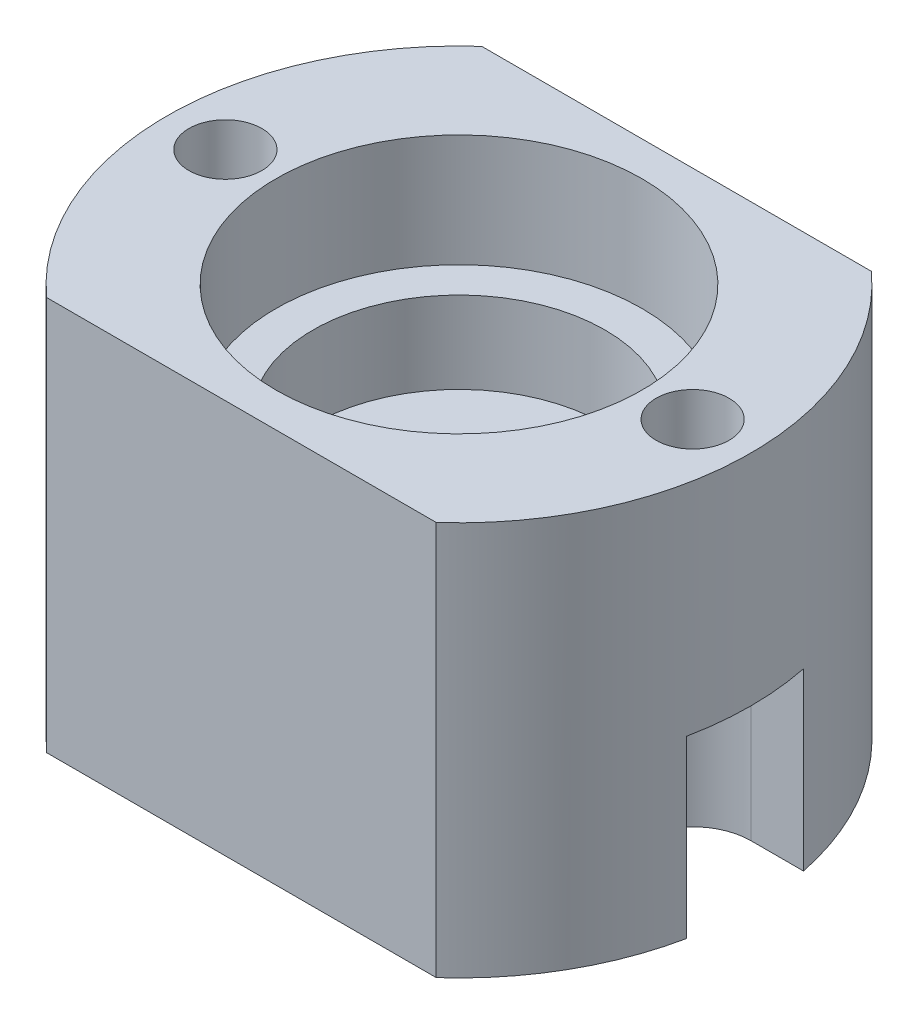
ISO-10303-21;
HEADER;
FILE_DESCRIPTION(('STEP AP214'),'2;1');
FILE_NAME('part.step','',(''),(''),'','','');
FILE_SCHEMA(('AUTOMOTIVE_DESIGN { 1 0 10303 214 1 1 1 1 }'));
ENDSEC;
DATA;
#1=APPLICATION_CONTEXT('core data for automotive mechanical design processes');
#2=APPLICATION_PROTOCOL_DEFINITION('international standard','automotive_design',2000,#1);
#3=PRODUCT_CONTEXT('',#1,'mechanical');
#4=PRODUCT('Part','Part','',(#3));
#5=PRODUCT_RELATED_PRODUCT_CATEGORY('part','',(#4));
#6=PRODUCT_DEFINITION_FORMATION('','',#4);
#7=PRODUCT_DEFINITION_CONTEXT('part definition',#1,'design');
#8=PRODUCT_DEFINITION('design','',#6,#7);
#9=PRODUCT_DEFINITION_SHAPE('','',#8);
#10=(LENGTH_UNIT() NAMED_UNIT(*) SI_UNIT(.MILLI.,.METRE.));
#11=(NAMED_UNIT(*) PLANE_ANGLE_UNIT() SI_UNIT($,.RADIAN.));
#12=(NAMED_UNIT(*) SI_UNIT($,.STERADIAN.) SOLID_ANGLE_UNIT());
#13=UNCERTAINTY_MEASURE_WITH_UNIT(LENGTH_MEASURE(1.E-05),#10,'distance_accuracy_value','');
#14=(GEOMETRIC_REPRESENTATION_CONTEXT(3) GLOBAL_UNCERTAINTY_ASSIGNED_CONTEXT((#13)) GLOBAL_UNIT_ASSIGNED_CONTEXT((#10,
#11,#12)) REPRESENTATION_CONTEXT('',''));
#15=CARTESIAN_POINT('',(0.,0.,0.));
#16=DIRECTION('',(0.,0.,1.));
#17=DIRECTION('',(1.,0.,0.));
#18=AXIS2_PLACEMENT_3D('',#15,#16,#17);
#19=CARTESIAN_POINT('',(0.,12.2555,0.));
#20=DIRECTION('',(0.,1.,0.));
#21=DIRECTION('',(0.,0.,1.));
#22=AXIS2_PLACEMENT_3D('',#19,#20,#21);
#23=PLANE('',#22);
#24=CARTESIAN_POINT('',(0.,12.2555,0.));
#25=DIRECTION('',(0.,1.,0.));
#26=DIRECTION('',(0.,0.,1.));
#27=AXIS2_PLACEMENT_3D('',#24,#25,#26);
#28=CIRCLE('',#27,7.9629);
#29=CARTESIAN_POINT('',(0.,12.2555,7.9629));
#30=VERTEX_POINT('',#29);
#31=EDGE_CURVE('E211',#30,#30,#28,.T.);
#32=ORIENTED_EDGE('',*,*,#31,.T.);
#33=EDGE_LOOP('',(#32));
#34=FACE_BOUND('',#33,.T.);
#35=CARTESIAN_POINT('',(0.,12.2555,0.));
#36=DIRECTION('',(0.,1.,0.));
#37=DIRECTION('',(0.,0.,1.));
#38=AXIS2_PLACEMENT_3D('',#35,#36,#37);
#39=CIRCLE('',#38,6.35);
#40=CARTESIAN_POINT('',(0.,12.2555,6.35));
#41=VERTEX_POINT('',#40);
#42=EDGE_CURVE('E20',#41,#41,#39,.F.);
#43=ORIENTED_EDGE('',*,*,#42,.T.);
#44=EDGE_LOOP('',(#43));
#45=FACE_BOUND('',#44,.T.);
#46=ADVANCED_FACE('F17',(#34,#45),#23,.T.);
#47=CARTESIAN_POINT('',(0.,8.6995,0.));
#48=DIRECTION('',(0.,1.,0.));
#49=DIRECTION('',(0.,0.,1.));
#50=AXIS2_PLACEMENT_3D('',#47,#48,#49);
#51=CYLINDRICAL_SURFACE('',#50,6.35);
#52=ORIENTED_EDGE('',*,*,#42,.F.);
#53=EDGE_LOOP('',(#52));
#54=FACE_BOUND('',#53,.T.);
#55=CARTESIAN_POINT('',(0.,8.6995,0.));
#56=DIRECTION('',(0.,1.,0.));
#57=DIRECTION('',(0.,0.,1.));
#58=AXIS2_PLACEMENT_3D('',#55,#56,#57);
#59=CIRCLE('',#58,6.35);
#60=CARTESIAN_POINT('',(0.,8.6995,6.35));
#61=VERTEX_POINT('',#60);
#62=EDGE_CURVE('E209',#61,#61,#59,.T.);
#63=ORIENTED_EDGE('',*,*,#62,.F.);
#64=EDGE_LOOP('',(#63));
#65=FACE_BOUND('',#64,.T.);
#66=ADVANCED_FACE('F219',(#54,#65),#51,.F.);
#67=CARTESIAN_POINT('',(0.,12.2555,0.));
#68=DIRECTION('',(0.,1.,0.));
#69=DIRECTION('',(0.,0.,1.));
#70=AXIS2_PLACEMENT_3D('',#67,#68,#69);
#71=CYLINDRICAL_SURFACE('',#70,7.9629);
#72=CARTESIAN_POINT('',(0.,17.145,0.));
#73=DIRECTION('',(0.,1.,0.));
#74=DIRECTION('',(0.,0.,1.));
#75=AXIS2_PLACEMENT_3D('',#72,#73,#74);
#76=CIRCLE('',#75,7.9629);
#77=CARTESIAN_POINT('',(0.,17.145,7.9629));
#78=VERTEX_POINT('',#77);
#79=EDGE_CURVE('E203',#78,#78,#76,.F.);
#80=ORIENTED_EDGE('',*,*,#79,.F.);
#81=EDGE_LOOP('',(#80));
#82=FACE_BOUND('',#81,.T.);
#83=ORIENTED_EDGE('',*,*,#31,.F.);
#84=EDGE_LOOP('',(#83));
#85=FACE_BOUND('',#84,.T.);
#86=ADVANCED_FACE('F222',(#82,#85),#71,.F.);
#87=CARTESIAN_POINT('',(-10.16,17.145,0.));
#88=DIRECTION('',(0.,-1.,0.));
#89=DIRECTION('',(0.,0.,-1.));
#90=AXIS2_PLACEMENT_3D('',#87,#88,#89);
#91=CYLINDRICAL_SURFACE('',#90,1.5875);
#92=CARTESIAN_POINT('',(-10.16,17.145,0.));
#93=DIRECTION('',(0.,-1.,0.));
#94=DIRECTION('',(0.,0.,-1.));
#95=AXIS2_PLACEMENT_3D('',#92,#93,#94);
#96=CIRCLE('',#95,1.5875);
#97=CARTESIAN_POINT('',(-10.16,17.145,-1.5875));
#98=VERTEX_POINT('',#97);
#99=EDGE_CURVE('E197',#98,#98,#96,.T.);
#100=ORIENTED_EDGE('',*,*,#99,.F.);
#101=EDGE_LOOP('',(#100));
#102=FACE_BOUND('',#101,.T.);
#103=CARTESIAN_POINT('',(-10.16,7.62,0.));
#104=DIRECTION('',(0.,-1.,0.));
#105=DIRECTION('',(0.,0.,-1.));
#106=AXIS2_PLACEMENT_3D('',#103,#104,#105);
#107=CIRCLE('',#106,1.5875);
#108=CARTESIAN_POINT('',(-10.16,7.62,-1.5875));
#109=VERTEX_POINT('',#108);
#110=EDGE_CURVE('E206',#109,#109,#107,.F.);
#111=ORIENTED_EDGE('',*,*,#110,.F.);
#112=EDGE_LOOP('',(#111));
#113=FACE_BOUND('',#112,.T.);
#114=ADVANCED_FACE('F330',(#102,#113),#91,.F.);
#115=CARTESIAN_POINT('',(10.16,17.145,0.));
#116=DIRECTION('',(0.,-1.,0.));
#117=DIRECTION('',(0.,0.,-1.));
#118=AXIS2_PLACEMENT_3D('',#115,#116,#117);
#119=CYLINDRICAL_SURFACE('',#118,1.5875);
#120=CARTESIAN_POINT('',(10.16,7.62,0.));
#121=DIRECTION('',(0.,-1.,0.));
#122=DIRECTION('',(0.,0.,-1.));
#123=AXIS2_PLACEMENT_3D('',#120,#121,#122);
#124=CIRCLE('',#123,1.5875);
#125=CARTESIAN_POINT('',(10.16,7.62,-1.5875));
#126=VERTEX_POINT('',#125);
#127=EDGE_CURVE('E194',#126,#126,#124,.F.);
#128=ORIENTED_EDGE('',*,*,#127,.F.);
#129=EDGE_LOOP('',(#128));
#130=FACE_BOUND('',#129,.T.);
#131=CARTESIAN_POINT('',(10.16,17.145,0.));
#132=DIRECTION('',(0.,-1.,0.));
#133=DIRECTION('',(0.,0.,-1.));
#134=AXIS2_PLACEMENT_3D('',#131,#132,#133);
#135=CIRCLE('',#134,1.5875);
#136=CARTESIAN_POINT('',(10.16,17.145,-1.5875));
#137=VERTEX_POINT('',#136);
#138=EDGE_CURVE('E200',#137,#137,#135,.T.);
#139=ORIENTED_EDGE('',*,*,#138,.F.);
#140=EDGE_LOOP('',(#139));
#141=FACE_BOUND('',#140,.T.);
#142=ADVANCED_FACE('F228',(#130,#141),#119,.F.);
#143=CARTESIAN_POINT('',(0.,8.6995,0.));
#144=DIRECTION('',(0.,1.,0.));
#145=DIRECTION('',(0.,0.,1.));
#146=AXIS2_PLACEMENT_3D('',#143,#144,#145);
#147=PLANE('',#146);
#148=ORIENTED_EDGE('',*,*,#62,.T.);
#149=EDGE_LOOP('',(#148));
#150=FACE_BOUND('',#149,.T.);
#151=CARTESIAN_POINT('',(0.,8.6995,0.));
#152=DIRECTION('',(0.,1.,0.));
#153=DIRECTION('',(0.,0.,1.));
#154=AXIS2_PLACEMENT_3D('',#151,#152,#153);
#155=CIRCLE('',#154,2.70509999999999);
#156=CARTESIAN_POINT('',(0.,8.6995,2.70509999999999));
#157=VERTEX_POINT('',#156);
#158=EDGE_CURVE('E152',#157,#157,#155,.F.);
#159=ORIENTED_EDGE('',*,*,#158,.T.);
#160=EDGE_LOOP('',(#159));
#161=FACE_BOUND('',#160,.T.);
#162=ADVANCED_FACE('F225',(#150,#161),#147,.T.);
#163=CARTESIAN_POINT('',(-10.16,7.62,0.));
#164=DIRECTION('',(0.,-1.,0.));
#165=DIRECTION('',(0.,0.,-1.));
#166=AXIS2_PLACEMENT_3D('',#163,#164,#165);
#167=PLANE('',#166);
#168=CARTESIAN_POINT('',(0.,7.62,0.));
#169=DIRECTION('',(0.,-1.,0.));
#170=DIRECTION('',(0.,0.,-1.));
#171=AXIS2_PLACEMENT_3D('',#168,#169,#170);
#172=CIRCLE('',#171,12.7);
#173=CARTESIAN_POINT('',(-12.4434078933385,7.62,-2.54));
#174=VERTEX_POINT('',#173);
#175=CARTESIAN_POINT('',(-12.4434078933385,7.62,2.54));
#176=VERTEX_POINT('',#175);
#177=EDGE_CURVE('E140',#174,#176,#172,.F.);
#178=ORIENTED_EDGE('',*,*,#177,.F.);
#179=DIRECTION('',(-1.,0.,0.));
#180=VECTOR('',#179,1.);
#181=CARTESIAN_POINT('',(-10.16,7.62,-2.54));
#182=LINE('',#181,#180);
#183=CARTESIAN_POINT('',(-10.16,7.62,-2.54));
#184=VERTEX_POINT('',#183);
#185=EDGE_CURVE('E103',#174,#184,#182,.F.);
#186=ORIENTED_EDGE('',*,*,#185,.T.);
#187=CARTESIAN_POINT('',(-10.16,7.62,0.));
#188=DIRECTION('',(0.,-1.,0.));
#189=DIRECTION('',(0.,0.,-1.));
#190=AXIS2_PLACEMENT_3D('',#187,#188,#189);
#191=CIRCLE('',#190,2.54);
#192=CARTESIAN_POINT('',(-10.16,7.62,2.54));
#193=VERTEX_POINT('',#192);
#194=EDGE_CURVE('E106',#184,#193,#191,.T.);
#195=ORIENTED_EDGE('',*,*,#194,.T.);
#196=DIRECTION('',(1.,0.,0.));
#197=VECTOR('',#196,1.);
#198=CARTESIAN_POINT('',(-10.16,7.62,2.54));
#199=LINE('',#198,#197);
#200=EDGE_CURVE('E110',#193,#176,#199,.F.);
#201=ORIENTED_EDGE('',*,*,#200,.T.);
#202=EDGE_LOOP('',(#178,#186,#195,#201));
#203=FACE_BOUND('',#202,.T.);
#204=ORIENTED_EDGE('',*,*,#110,.T.);
#205=EDGE_LOOP('',(#204));
#206=FACE_BOUND('',#205,.T.);
#207=ADVANCED_FACE('F108',(#203,#206),#167,.T.);
#208=CARTESIAN_POINT('',(0.,17.145,0.));
#209=DIRECTION('',(0.,1.,0.));
#210=DIRECTION('',(0.,0.,1.));
#211=AXIS2_PLACEMENT_3D('',#208,#209,#210);
#212=PLANE('',#211);
#213=ORIENTED_EDGE('',*,*,#99,.T.);
#214=EDGE_LOOP('',(#213));
#215=FACE_BOUND('',#214,.T.);
#216=CARTESIAN_POINT('',(0.,17.145,0.));
#217=DIRECTION('',(0.,-1.,0.));
#218=DIRECTION('',(0.,0.,-1.));
#219=AXIS2_PLACEMENT_3D('',#216,#217,#218);
#220=CIRCLE('',#219,12.7);
#221=CARTESIAN_POINT('',(-8.47171870106651,17.145,9.4615));
#222=VERTEX_POINT('',#221);
#223=CARTESIAN_POINT('',(-8.47171870106651,17.145,-9.4615));
#224=VERTEX_POINT('',#223);
#225=EDGE_CURVE('E137',#222,#224,#220,.T.);
#226=ORIENTED_EDGE('',*,*,#225,.F.);
#227=DIRECTION('',(-1.,0.,0.));
#228=VECTOR('',#227,1.);
#229=CARTESIAN_POINT('',(-8.47171870106651,17.145,9.4615));
#230=LINE('',#229,#228);
#231=CARTESIAN_POINT('',(8.47171870106651,17.145,9.4615));
#232=VERTEX_POINT('',#231);
#233=EDGE_CURVE('E156',#222,#232,#230,.F.);
#234=ORIENTED_EDGE('',*,*,#233,.T.);
#235=CARTESIAN_POINT('',(0.,17.145,0.));
#236=DIRECTION('',(0.,-1.,0.));
#237=DIRECTION('',(0.,0.,-1.));
#238=AXIS2_PLACEMENT_3D('',#235,#236,#237);
#239=CIRCLE('',#238,12.7);
#240=CARTESIAN_POINT('',(8.47171870106651,17.145,-9.4615));
#241=VERTEX_POINT('',#240);
#242=EDGE_CURVE('E147',#241,#232,#239,.T.);
#243=ORIENTED_EDGE('',*,*,#242,.F.);
#244=DIRECTION('',(1.,0.,0.));
#245=VECTOR('',#244,1.);
#246=CARTESIAN_POINT('',(-8.47171870106651,17.145,-9.4615));
#247=LINE('',#246,#245);
#248=EDGE_CURVE('E151',#241,#224,#247,.F.);
#249=ORIENTED_EDGE('',*,*,#248,.T.);
#250=EDGE_LOOP('',(#226,#234,#243,#249));
#251=FACE_BOUND('',#250,.T.);
#252=ORIENTED_EDGE('',*,*,#138,.T.);
#253=EDGE_LOOP('',(#252));
#254=FACE_BOUND('',#253,.T.);
#255=ORIENTED_EDGE('',*,*,#79,.T.);
#256=EDGE_LOOP('',(#255));
#257=FACE_BOUND('',#256,.T.);
#258=ADVANCED_FACE('F246',(#215,#251,#254,#257),#212,.T.);
#259=CARTESIAN_POINT('',(10.16,7.62,0.));
#260=DIRECTION('',(0.,-1.,0.));
#261=DIRECTION('',(0.,0.,-1.));
#262=AXIS2_PLACEMENT_3D('',#259,#260,#261);
#263=PLANE('',#262);
#264=CARTESIAN_POINT('',(0.,7.62,0.));
#265=DIRECTION('',(0.,-1.,0.));
#266=DIRECTION('',(0.,0.,-1.));
#267=AXIS2_PLACEMENT_3D('',#264,#265,#266);
#268=CIRCLE('',#267,12.7);
#269=CARTESIAN_POINT('',(12.4434078933385,7.62,2.54));
#270=VERTEX_POINT('',#269);
#271=CARTESIAN_POINT('',(12.4434078933385,7.62,-2.54));
#272=VERTEX_POINT('',#271);
#273=EDGE_CURVE('E144',#270,#272,#268,.F.);
#274=ORIENTED_EDGE('',*,*,#273,.F.);
#275=DIRECTION('',(1.,0.,0.));
#276=VECTOR('',#275,1.);
#277=CARTESIAN_POINT('',(10.16,7.62,2.54));
#278=LINE('',#277,#276);
#279=CARTESIAN_POINT('',(10.16,7.62,2.54));
#280=VERTEX_POINT('',#279);
#281=EDGE_CURVE('E153',#270,#280,#278,.F.);
#282=ORIENTED_EDGE('',*,*,#281,.T.);
#283=CARTESIAN_POINT('',(10.16,7.62,0.));
#284=DIRECTION('',(0.,-1.,0.));
#285=DIRECTION('',(0.,0.,-1.));
#286=AXIS2_PLACEMENT_3D('',#283,#284,#285);
#287=CIRCLE('',#286,2.54);
#288=CARTESIAN_POINT('',(10.16,7.62,-2.54));
#289=VERTEX_POINT('',#288);
#290=EDGE_CURVE('E184',#280,#289,#287,.T.);
#291=ORIENTED_EDGE('',*,*,#290,.T.);
#292=DIRECTION('',(-1.,0.,0.));
#293=VECTOR('',#292,1.);
#294=CARTESIAN_POINT('',(10.16,7.62,-2.54));
#295=LINE('',#294,#293);
#296=EDGE_CURVE('E148',#289,#272,#295,.F.);
#297=ORIENTED_EDGE('',*,*,#296,.T.);
#298=EDGE_LOOP('',(#274,#282,#291,#297));
#299=FACE_BOUND('',#298,.T.);
#300=ORIENTED_EDGE('',*,*,#127,.T.);
#301=EDGE_LOOP('',(#300));
#302=FACE_BOUND('',#301,.T.);
#303=ADVANCED_FACE('F235',(#299,#302),#263,.T.);
#304=CARTESIAN_POINT('',(0.,8.6995,0.));
#305=DIRECTION('',(0.,1.,0.));
#306=DIRECTION('',(0.,0.,1.));
#307=AXIS2_PLACEMENT_3D('',#304,#305,#306);
#308=CYLINDRICAL_SURFACE('',#307,2.70509999999999);
#309=CARTESIAN_POINT('',(0.,0.,0.));
#310=DIRECTION('',(0.,1.,0.));
#311=DIRECTION('',(0.,0.,1.));
#312=AXIS2_PLACEMENT_3D('',#309,#310,#311);
#313=CIRCLE('',#312,2.70509999999999);
#314=CARTESIAN_POINT('',(0.,0.,2.70509999999999));
#315=VERTEX_POINT('',#314);
#316=EDGE_CURVE('E180',#315,#315,#313,.F.);
#317=ORIENTED_EDGE('',*,*,#316,.T.);
#318=EDGE_LOOP('',(#317));
#319=FACE_BOUND('',#318,.T.);
#320=ORIENTED_EDGE('',*,*,#158,.F.);
#321=EDGE_LOOP('',(#320));
#322=FACE_BOUND('',#321,.T.);
#323=ADVANCED_FACE('F232',(#319,#322),#308,.F.);
#324=CARTESIAN_POINT('',(10.16,7.62,-2.54));
#325=DIRECTION('',(0.,0.,-1.));
#326=DIRECTION('',(-1.,0.,0.));
#327=AXIS2_PLACEMENT_3D('',#324,#325,#326);
#328=PLANE('',#327);
#329=DIRECTION('',(0.,-1.,0.));
#330=VECTOR('',#329,1.);
#331=CARTESIAN_POINT('',(12.4434078933385,17.145,-2.54));
#332=LINE('',#331,#330);
#333=CARTESIAN_POINT('',(12.4434078933385,0.,-2.54));
#334=VERTEX_POINT('',#333);
#335=EDGE_CURVE('E141',#272,#334,#332,.T.);
#336=ORIENTED_EDGE('',*,*,#335,.F.);
#337=ORIENTED_EDGE('',*,*,#296,.F.);
#338=DIRECTION('',(0.,-1.,0.));
#339=VECTOR('',#338,1.);
#340=CARTESIAN_POINT('',(10.16,7.62,-2.54));
#341=LINE('',#340,#339);
#342=CARTESIAN_POINT('',(10.16,0.,-2.54));
#343=VERTEX_POINT('',#342);
#344=EDGE_CURVE('E183',#289,#343,#341,.T.);
#345=ORIENTED_EDGE('',*,*,#344,.T.);
#346=DIRECTION('',(1.,0.,0.));
#347=VECTOR('',#346,1.);
#348=CARTESIAN_POINT('',(0.,0.,-2.54));
#349=LINE('',#348,#347);
#350=EDGE_CURVE('E179',#343,#334,#349,.T.);
#351=ORIENTED_EDGE('',*,*,#350,.T.);
#352=EDGE_LOOP('',(#336,#337,#345,#351));
#353=FACE_BOUND('',#352,.T.);
#354=ADVANCED_FACE('F234',(#353),#328,.F.);
#355=CARTESIAN_POINT('',(-8.47171870106651,17.145,-9.4615));
#356=DIRECTION('',(0.,0.,1.));
#357=DIRECTION('',(1.,0.,0.));
#358=AXIS2_PLACEMENT_3D('',#355,#356,#357);
#359=PLANE('',#358);
#360=DIRECTION('',(0.,-1.,0.));
#361=VECTOR('',#360,1.);
#362=CARTESIAN_POINT('',(-8.47171870106651,17.145,-9.4615));
#363=LINE('',#362,#361);
#364=CARTESIAN_POINT('',(-8.47171870106651,0.,-9.4615));
#365=VERTEX_POINT('',#364);
#366=EDGE_CURVE('E134',#224,#365,#363,.T.);
#367=ORIENTED_EDGE('',*,*,#366,.F.);
#368=ORIENTED_EDGE('',*,*,#248,.F.);
#369=DIRECTION('',(0.,-1.,0.));
#370=VECTOR('',#369,1.);
#371=CARTESIAN_POINT('',(8.47171870106651,17.145,-9.4615));
#372=LINE('',#371,#370);
#373=CARTESIAN_POINT('',(8.47171870106651,0.,-9.4615));
#374=VERTEX_POINT('',#373);
#375=EDGE_CURVE('E143',#374,#241,#372,.F.);
#376=ORIENTED_EDGE('',*,*,#375,.F.);
#377=DIRECTION('',(1.,0.,0.));
#378=VECTOR('',#377,1.);
#379=CARTESIAN_POINT('',(0.,0.,-9.4615));
#380=LINE('',#379,#378);
#381=EDGE_CURVE('E175',#374,#365,#380,.F.);
#382=ORIENTED_EDGE('',*,*,#381,.T.);
#383=EDGE_LOOP('',(#367,#368,#376,#382));
#384=FACE_BOUND('',#383,.T.);
#385=ADVANCED_FACE('F243',(#384),#359,.F.);
#386=CARTESIAN_POINT('',(-10.16,7.62,-2.54));
#387=DIRECTION('',(0.,0.,-1.));
#388=DIRECTION('',(-1.,0.,0.));
#389=AXIS2_PLACEMENT_3D('',#386,#387,#388);
#390=PLANE('',#389);
#391=DIRECTION('',(0.,-1.,0.));
#392=VECTOR('',#391,1.);
#393=CARTESIAN_POINT('',(-10.16,7.62,-2.54));
#394=LINE('',#393,#392);
#395=CARTESIAN_POINT('',(-10.16,0.,-2.54));
#396=VERTEX_POINT('',#395);
#397=EDGE_CURVE('E116',#396,#184,#394,.F.);
#398=ORIENTED_EDGE('',*,*,#397,.T.);
#399=ORIENTED_EDGE('',*,*,#185,.F.);
#400=DIRECTION('',(0.,-1.,0.));
#401=VECTOR('',#400,1.);
#402=CARTESIAN_POINT('',(-12.4434078933385,17.145,-2.54));
#403=LINE('',#402,#401);
#404=CARTESIAN_POINT('',(-12.4434078933385,0.,-2.54));
#405=VERTEX_POINT('',#404);
#406=EDGE_CURVE('E123',#405,#174,#403,.F.);
#407=ORIENTED_EDGE('',*,*,#406,.F.);
#408=DIRECTION('',(1.,0.,0.));
#409=VECTOR('',#408,1.);
#410=CARTESIAN_POINT('',(0.,0.,-2.54));
#411=LINE('',#410,#409);
#412=EDGE_CURVE('E171',#405,#396,#411,.T.);
#413=ORIENTED_EDGE('',*,*,#412,.T.);
#414=EDGE_LOOP('',(#398,#399,#407,#413));
#415=FACE_BOUND('',#414,.T.);
#416=ADVANCED_FACE('F281',(#415),#390,.F.);
#417=CARTESIAN_POINT('',(-10.16,7.62,0.));
#418=DIRECTION('',(0.,-1.,0.));
#419=DIRECTION('',(0.,0.,-1.));
#420=AXIS2_PLACEMENT_3D('',#417,#418,#419);
#421=CYLINDRICAL_SURFACE('',#420,2.54);
#422=DIRECTION('',(0.,1.,0.));
#423=VECTOR('',#422,1.);
#424=CARTESIAN_POINT('',(-10.16,7.62,2.54));
#425=LINE('',#424,#423);
#426=CARTESIAN_POINT('',(-10.16,0.,2.54));
#427=VERTEX_POINT('',#426);
#428=EDGE_CURVE('E115',#427,#193,#425,.T.);
#429=ORIENTED_EDGE('',*,*,#428,.T.);
#430=ORIENTED_EDGE('',*,*,#194,.F.);
#431=ORIENTED_EDGE('',*,*,#397,.F.);
#432=CARTESIAN_POINT('',(-10.16,0.,0.));
#433=DIRECTION('',(0.,-1.,0.));
#434=DIRECTION('',(0.,0.,-1.));
#435=AXIS2_PLACEMENT_3D('',#432,#433,#434);
#436=CIRCLE('',#435,2.54);
#437=EDGE_CURVE('E128',#396,#427,#436,.T.);
#438=ORIENTED_EDGE('',*,*,#437,.T.);
#439=EDGE_LOOP('',(#429,#430,#431,#438));
#440=FACE_BOUND('',#439,.T.);
#441=ADVANCED_FACE('F126',(#440),#421,.F.);
#442=CARTESIAN_POINT('',(-10.16,7.62,2.54));
#443=DIRECTION('',(0.,0.,1.));
#444=DIRECTION('',(1.,0.,0.));
#445=AXIS2_PLACEMENT_3D('',#442,#443,#444);
#446=PLANE('',#445);
#447=DIRECTION('',(0.,-1.,0.));
#448=VECTOR('',#447,1.);
#449=CARTESIAN_POINT('',(-12.4434078933385,17.145,2.54));
#450=LINE('',#449,#448);
#451=CARTESIAN_POINT('',(-12.4434078933385,0.,2.54));
#452=VERTEX_POINT('',#451);
#453=EDGE_CURVE('E122',#176,#452,#450,.T.);
#454=ORIENTED_EDGE('',*,*,#453,.F.);
#455=ORIENTED_EDGE('',*,*,#200,.F.);
#456=ORIENTED_EDGE('',*,*,#428,.F.);
#457=DIRECTION('',(1.,0.,0.));
#458=VECTOR('',#457,1.);
#459=CARTESIAN_POINT('',(0.,0.,2.54));
#460=LINE('',#459,#458);
#461=EDGE_CURVE('E169',#427,#452,#460,.F.);
#462=ORIENTED_EDGE('',*,*,#461,.T.);
#463=EDGE_LOOP('',(#454,#455,#456,#462));
#464=FACE_BOUND('',#463,.T.);
#465=ADVANCED_FACE('F119',(#464),#446,.F.);
#466=CARTESIAN_POINT('',(0.,17.145,0.));
#467=DIRECTION('',(0.,-1.,0.));
#468=DIRECTION('',(0.,0.,-1.));
#469=AXIS2_PLACEMENT_3D('',#466,#467,#468);
#470=CYLINDRICAL_SURFACE('',#469,12.7);
#471=ORIENTED_EDGE('',*,*,#225,.T.);
#472=ORIENTED_EDGE('',*,*,#366,.T.);
#473=CARTESIAN_POINT('',(0.,0.,0.));
#474=DIRECTION('',(0.,-1.,0.));
#475=DIRECTION('',(0.,0.,-1.));
#476=AXIS2_PLACEMENT_3D('',#473,#474,#475);
#477=CIRCLE('',#476,12.7);
#478=EDGE_CURVE('E172',#365,#405,#477,.F.);
#479=ORIENTED_EDGE('',*,*,#478,.T.);
#480=ORIENTED_EDGE('',*,*,#406,.T.);
#481=ORIENTED_EDGE('',*,*,#177,.T.);
#482=ORIENTED_EDGE('',*,*,#453,.T.);
#483=CARTESIAN_POINT('',(0.,0.,0.));
#484=DIRECTION('',(0.,-1.,0.));
#485=DIRECTION('',(0.,0.,-1.));
#486=AXIS2_PLACEMENT_3D('',#483,#484,#485);
#487=CIRCLE('',#486,12.7);
#488=CARTESIAN_POINT('',(-8.47171870106651,0.,9.4615));
#489=VERTEX_POINT('',#488);
#490=EDGE_CURVE('E166',#452,#489,#487,.F.);
#491=ORIENTED_EDGE('',*,*,#490,.T.);
#492=DIRECTION('',(0.,1.,0.));
#493=VECTOR('',#492,1.);
#494=CARTESIAN_POINT('',(-8.47171870106651,17.145,9.4615));
#495=LINE('',#494,#493);
#496=EDGE_CURVE('E136',#489,#222,#495,.T.);
#497=ORIENTED_EDGE('',*,*,#496,.T.);
#498=EDGE_LOOP('',(#471,#472,#479,#480,#481,#482,#491,#497));
#499=FACE_BOUND('',#498,.T.);
#500=ADVANCED_FACE('F272',(#499),#470,.T.);
#501=CARTESIAN_POINT('',(-8.47171870106651,17.145,9.4615));
#502=DIRECTION('',(0.,0.,-1.));
#503=DIRECTION('',(-1.,0.,0.));
#504=AXIS2_PLACEMENT_3D('',#501,#502,#503);
#505=PLANE('',#504);
#506=DIRECTION('',(0.,-1.,0.));
#507=VECTOR('',#506,1.);
#508=CARTESIAN_POINT('',(8.47171870106651,17.145,9.4615));
#509=LINE('',#508,#507);
#510=CARTESIAN_POINT('',(8.47171870106651,0.,9.4615));
#511=VERTEX_POINT('',#510);
#512=EDGE_CURVE('E188',#232,#511,#509,.T.);
#513=ORIENTED_EDGE('',*,*,#512,.F.);
#514=ORIENTED_EDGE('',*,*,#233,.F.);
#515=ORIENTED_EDGE('',*,*,#496,.F.);
#516=DIRECTION('',(1.,0.,0.));
#517=VECTOR('',#516,1.);
#518=CARTESIAN_POINT('',(0.,0.,9.4615));
#519=LINE('',#518,#517);
#520=EDGE_CURVE('E165',#489,#511,#519,.T.);
#521=ORIENTED_EDGE('',*,*,#520,.T.);
#522=EDGE_LOOP('',(#513,#514,#515,#521));
#523=FACE_BOUND('',#522,.T.);
#524=ADVANCED_FACE('F268',(#523),#505,.F.);
#525=CARTESIAN_POINT('',(0.,17.145,0.));
#526=DIRECTION('',(0.,-1.,0.));
#527=DIRECTION('',(0.,0.,-1.));
#528=AXIS2_PLACEMENT_3D('',#525,#526,#527);
#529=CYLINDRICAL_SURFACE('',#528,12.7);
#530=ORIENTED_EDGE('',*,*,#242,.T.);
#531=ORIENTED_EDGE('',*,*,#512,.T.);
#532=CARTESIAN_POINT('',(0.,0.,0.));
#533=DIRECTION('',(0.,-1.,0.));
#534=DIRECTION('',(0.,0.,-1.));
#535=AXIS2_PLACEMENT_3D('',#532,#533,#534);
#536=CIRCLE('',#535,12.7);
#537=CARTESIAN_POINT('',(12.4434078933385,0.,2.54));
#538=VERTEX_POINT('',#537);
#539=EDGE_CURVE('E162',#511,#538,#536,.F.);
#540=ORIENTED_EDGE('',*,*,#539,.T.);
#541=DIRECTION('',(0.,1.,0.));
#542=VECTOR('',#541,1.);
#543=CARTESIAN_POINT('',(12.4434078933385,7.62,2.54));
#544=LINE('',#543,#542);
#545=EDGE_CURVE('E155',#538,#270,#544,.T.);
#546=ORIENTED_EDGE('',*,*,#545,.T.);
#547=ORIENTED_EDGE('',*,*,#273,.T.);
#548=ORIENTED_EDGE('',*,*,#335,.T.);
#549=CARTESIAN_POINT('',(0.,0.,0.));
#550=DIRECTION('',(0.,-1.,0.));
#551=DIRECTION('',(0.,0.,-1.));
#552=AXIS2_PLACEMENT_3D('',#549,#550,#551);
#553=CIRCLE('',#552,12.7);
#554=EDGE_CURVE('E176',#334,#374,#553,.F.);
#555=ORIENTED_EDGE('',*,*,#554,.T.);
#556=ORIENTED_EDGE('',*,*,#375,.T.);
#557=EDGE_LOOP('',(#530,#531,#540,#546,#547,#548,#555,#556));
#558=FACE_BOUND('',#557,.T.);
#559=ADVANCED_FACE('F264',(#558),#529,.T.);
#560=CARTESIAN_POINT('',(10.16,7.62,2.54));
#561=DIRECTION('',(0.,0.,1.));
#562=DIRECTION('',(1.,0.,0.));
#563=AXIS2_PLACEMENT_3D('',#560,#561,#562);
#564=PLANE('',#563);
#565=DIRECTION('',(0.,-1.,0.));
#566=VECTOR('',#565,1.);
#567=CARTESIAN_POINT('',(10.16,7.62,2.54));
#568=LINE('',#567,#566);
#569=CARTESIAN_POINT('',(10.16,0.,2.54));
#570=VERTEX_POINT('',#569);
#571=EDGE_CURVE('E34',#570,#280,#568,.F.);
#572=ORIENTED_EDGE('',*,*,#571,.T.);
#573=ORIENTED_EDGE('',*,*,#281,.F.);
#574=ORIENTED_EDGE('',*,*,#545,.F.);
#575=DIRECTION('',(1.,0.,0.));
#576=VECTOR('',#575,1.);
#577=CARTESIAN_POINT('',(0.,0.,2.54));
#578=LINE('',#577,#576);
#579=EDGE_CURVE('E26',#538,#570,#578,.F.);
#580=ORIENTED_EDGE('',*,*,#579,.T.);
#581=EDGE_LOOP('',(#572,#573,#574,#580));
#582=FACE_BOUND('',#581,.T.);
#583=ADVANCED_FACE('F257',(#582),#564,.F.);
#584=CARTESIAN_POINT('',(10.16,7.62,0.));
#585=DIRECTION('',(0.,-1.,0.));
#586=DIRECTION('',(0.,0.,-1.));
#587=AXIS2_PLACEMENT_3D('',#584,#585,#586);
#588=CYLINDRICAL_SURFACE('',#587,2.54);
#589=ORIENTED_EDGE('',*,*,#344,.F.);
#590=ORIENTED_EDGE('',*,*,#290,.F.);
#591=ORIENTED_EDGE('',*,*,#571,.F.);
#592=CARTESIAN_POINT('',(10.16,0.,0.));
#593=DIRECTION('',(0.,-1.,0.));
#594=DIRECTION('',(0.,0.,-1.));
#595=AXIS2_PLACEMENT_3D('',#592,#593,#594);
#596=CIRCLE('',#595,2.54);
#597=EDGE_CURVE('E11',#570,#343,#596,.T.);
#598=ORIENTED_EDGE('',*,*,#597,.T.);
#599=EDGE_LOOP('',(#589,#590,#591,#598));
#600=FACE_BOUND('',#599,.T.);
#601=ADVANCED_FACE('F251',(#600),#588,.F.);
#602=CARTESIAN_POINT('',(0.,0.,0.));
#603=DIRECTION('',(0.,1.,0.));
#604=DIRECTION('',(0.,0.,1.));
#605=AXIS2_PLACEMENT_3D('',#602,#603,#604);
#606=PLANE('',#605);
#607=ORIENTED_EDGE('',*,*,#579,.F.);
#608=ORIENTED_EDGE('',*,*,#539,.F.);
#609=ORIENTED_EDGE('',*,*,#520,.F.);
#610=ORIENTED_EDGE('',*,*,#490,.F.);
#611=ORIENTED_EDGE('',*,*,#461,.F.);
#612=ORIENTED_EDGE('',*,*,#437,.F.);
#613=ORIENTED_EDGE('',*,*,#412,.F.);
#614=ORIENTED_EDGE('',*,*,#478,.F.);
#615=ORIENTED_EDGE('',*,*,#381,.F.);
#616=ORIENTED_EDGE('',*,*,#554,.F.);
#617=ORIENTED_EDGE('',*,*,#350,.F.);
#618=ORIENTED_EDGE('',*,*,#597,.F.);
#619=EDGE_LOOP('',(#607,#608,#609,#610,#611,#612,#613,#614,#615,#616,#617,#618));
#620=FACE_BOUND('',#619,.T.);
#621=ORIENTED_EDGE('',*,*,#316,.F.);
#622=EDGE_LOOP('',(#621));
#623=FACE_BOUND('',#622,.T.);
#624=ADVANCED_FACE('F249',(#620,#623),#606,.F.);
#625=CLOSED_SHELL('',(#46,#66,#86,#114,#142,#162,#207,#258,#303,#323,#354,#385,#416,#441,#465,
#500,#524,#559,#583,#601,#624));
#626=MANIFOLD_SOLID_BREP('B1',#625);
#627=ADVANCED_BREP_SHAPE_REPRESENTATION('',(#18,#626),#14);
#628=SHAPE_DEFINITION_REPRESENTATION(#9,#627);
ENDSEC;
END-ISO-10303-21;
